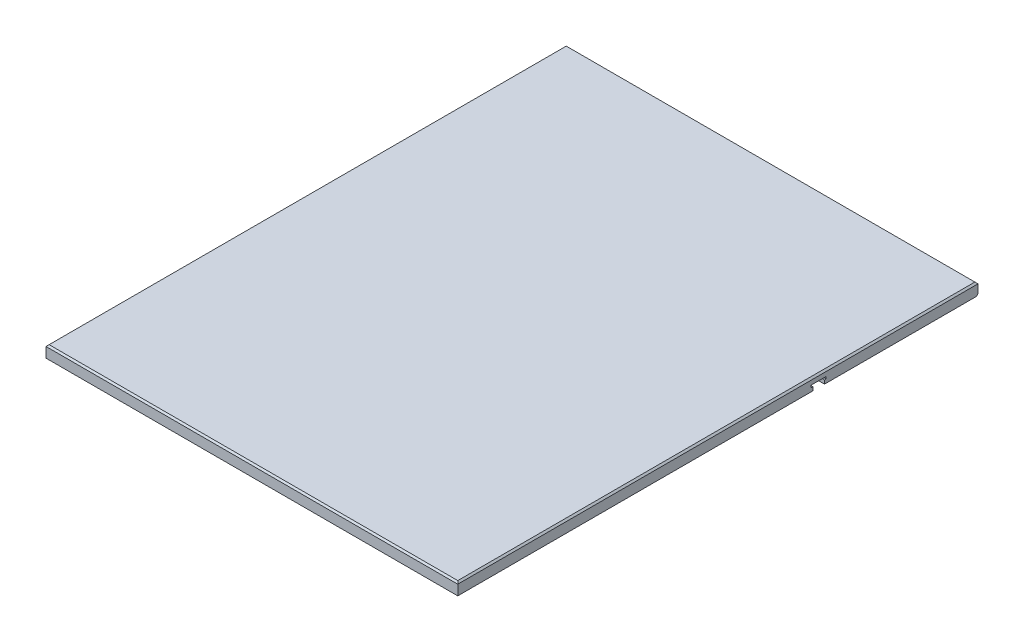
ISO-10303-21;
HEADER;
FILE_DESCRIPTION(('STEP AP214'),'2;1');
FILE_NAME('part.step','',(''),(''),'','','');
FILE_SCHEMA(('AUTOMOTIVE_DESIGN { 1 0 10303 214 1 1 1 1 }'));
ENDSEC;
DATA;
#1=APPLICATION_CONTEXT('core data for automotive mechanical design processes');
#2=APPLICATION_PROTOCOL_DEFINITION('international standard','automotive_design',2000,#1);
#3=PRODUCT_CONTEXT('',#1,'mechanical');
#4=PRODUCT('Part','Part','',(#3));
#5=PRODUCT_RELATED_PRODUCT_CATEGORY('part','',(#4));
#6=PRODUCT_DEFINITION_FORMATION('','',#4);
#7=PRODUCT_DEFINITION_CONTEXT('part definition',#1,'design');
#8=PRODUCT_DEFINITION('design','',#6,#7);
#9=PRODUCT_DEFINITION_SHAPE('','',#8);
#10=(LENGTH_UNIT() NAMED_UNIT(*) SI_UNIT(.MILLI.,.METRE.));
#11=(NAMED_UNIT(*) PLANE_ANGLE_UNIT() SI_UNIT($,.RADIAN.));
#12=(NAMED_UNIT(*) SI_UNIT($,.STERADIAN.) SOLID_ANGLE_UNIT());
#13=UNCERTAINTY_MEASURE_WITH_UNIT(LENGTH_MEASURE(1.E-05),#10,'distance_accuracy_value','');
#14=(GEOMETRIC_REPRESENTATION_CONTEXT(3) GLOBAL_UNCERTAINTY_ASSIGNED_CONTEXT((#13)) GLOBAL_UNIT_ASSIGNED_CONTEXT((#10,
#11,#12)) REPRESENTATION_CONTEXT('',''));
#15=CARTESIAN_POINT('',(0.,0.,0.));
#16=DIRECTION('',(0.,0.,1.));
#17=DIRECTION('',(1.,0.,0.));
#18=AXIS2_PLACEMENT_3D('',#15,#16,#17);
#19=CARTESIAN_POINT('',(0.,19.05,0.));
#20=DIRECTION('',(1.,0.,0.));
#21=DIRECTION('',(0.,0.,-1.));
#22=AXIS2_PLACEMENT_3D('',#19,#20,#21);
#23=PLANE('',#22);
#24=DIRECTION('',(0.,1.,0.));
#25=VECTOR('',#24,1.);
#26=CARTESIAN_POINT('',(0.,0.,-596.63076));
#27=LINE('',#26,#25);
#28=CARTESIAN_POINT('',(0.,0.,-596.63076));
#29=VERTEX_POINT('',#28);
#30=CARTESIAN_POINT('',(0.,5.97534999998061,-596.63076));
#31=VERTEX_POINT('',#30);
#32=EDGE_CURVE('E168',#29,#31,#27,.T.);
#33=ORIENTED_EDGE('',*,*,#32,.T.);
#34=DIRECTION('',(0.,0.,-1.));
#35=VECTOR('',#34,1.);
#36=CARTESIAN_POINT('',(0.,5.9753499999808,0.));
#37=LINE('',#36,#35);
#38=CARTESIAN_POINT('',(0.,5.97534999998061,-599.29776));
#39=VERTEX_POINT('',#38);
#40=EDGE_CURVE('E171',#31,#39,#37,.T.);
#41=ORIENTED_EDGE('',*,*,#40,.T.);
#42=DIRECTION('',(0.,1.,0.));
#43=VECTOR('',#42,1.);
#44=CARTESIAN_POINT('',(0.,0.,-599.29776));
#45=LINE('',#44,#43);
#46=CARTESIAN_POINT('',(0.,9.53134999998069,-599.29776));
#47=VERTEX_POINT('',#46);
#48=EDGE_CURVE('E192',#39,#47,#45,.T.);
#49=ORIENTED_EDGE('',*,*,#48,.T.);
#50=DIRECTION('',(0.,0.,1.));
#51=VECTOR('',#50,1.);
#52=CARTESIAN_POINT('',(0.,9.53134999998078,0.));
#53=LINE('',#52,#51);
#54=CARTESIAN_POINT('',(0.,9.5313499999807,-574.91376));
#55=VERTEX_POINT('',#54);
#56=EDGE_CURVE('E189',#47,#55,#53,.T.);
#57=ORIENTED_EDGE('',*,*,#56,.T.);
#58=DIRECTION('',(0.,-1.,0.));
#59=VECTOR('',#58,1.);
#60=CARTESIAN_POINT('',(0.,0.,-574.91376));
#61=LINE('',#60,#59);
#62=CARTESIAN_POINT('',(0.,5.97534999998061,-574.91376));
#63=VERTEX_POINT('',#62);
#64=EDGE_CURVE('E186',#55,#63,#61,.T.);
#65=ORIENTED_EDGE('',*,*,#64,.T.);
#66=DIRECTION('',(0.,0.,-1.));
#67=VECTOR('',#66,1.);
#68=CARTESIAN_POINT('',(0.,5.97534999998042,0.));
#69=LINE('',#68,#67);
#70=CARTESIAN_POINT('',(0.,5.97534999998061,-577.58076));
#71=VERTEX_POINT('',#70);
#72=EDGE_CURVE('E184',#63,#71,#69,.T.);
#73=ORIENTED_EDGE('',*,*,#72,.T.);
#74=DIRECTION('',(0.,-1.,0.));
#75=VECTOR('',#74,1.);
#76=CARTESIAN_POINT('',(0.,0.,-577.58076));
#77=LINE('',#76,#75);
#78=CARTESIAN_POINT('',(0.,0.,-577.58076));
#79=VERTEX_POINT('',#78);
#80=EDGE_CURVE('E160',#71,#79,#77,.T.);
#81=ORIENTED_EDGE('',*,*,#80,.T.);
#82=DIRECTION('',(0.,0.,1.));
#83=VECTOR('',#82,1.);
#84=CARTESIAN_POINT('',(0.,0.,0.));
#85=LINE('',#84,#83);
#86=CARTESIAN_POINT('',(0.,0.,0.));
#87=VERTEX_POINT('',#86);
#88=EDGE_CURVE('E215',#79,#87,#85,.T.);
#89=ORIENTED_EDGE('',*,*,#88,.T.);
#90=DIRECTION('',(0.,-1.,0.));
#91=VECTOR('',#90,1.);
#92=CARTESIAN_POINT('',(0.,19.05,0.));
#93=LINE('',#92,#91);
#94=CARTESIAN_POINT('',(0.,16.5100000000001,0.));
#95=VERTEX_POINT('',#94);
#96=EDGE_CURVE('E227',#95,#87,#93,.T.);
#97=ORIENTED_EDGE('',*,*,#96,.F.);
#98=DIRECTION('',(0.,0.,-1.));
#99=VECTOR('',#98,1.);
#100=CARTESIAN_POINT('',(0.,16.5100000000001,0.));
#101=LINE('',#100,#99);
#102=CARTESIAN_POINT('',(0.,16.5100000000001,-846.328));
#103=VERTEX_POINT('',#102);
#104=EDGE_CURVE('E246',#95,#103,#101,.T.);
#105=ORIENTED_EDGE('',*,*,#104,.T.);
#106=DIRECTION('',(0.,-1.,0.));
#107=VECTOR('',#106,1.);
#108=CARTESIAN_POINT('',(0.,19.05,-846.328));
#109=LINE('',#108,#107);
#110=CARTESIAN_POINT('',(0.,2.5400000000001,-846.328));
#111=VERTEX_POINT('',#110);
#112=EDGE_CURVE('E219',#103,#111,#109,.T.);
#113=ORIENTED_EDGE('',*,*,#112,.T.);
#114=DIRECTION('',(0.,-0.707106781186548,0.707106781186548));
#115=VECTOR('',#114,1.);
#116=CARTESIAN_POINT('',(0.,2.5400000000001,-846.328));
#117=LINE('',#116,#115);
#118=CARTESIAN_POINT('',(0.,0.,-843.788));
#119=VERTEX_POINT('',#118);
#120=EDGE_CURVE('E260',#111,#119,#117,.T.);
#121=ORIENTED_EDGE('',*,*,#120,.T.);
#122=EDGE_CURVE('E211',#119,#29,#85,.T.);
#123=ORIENTED_EDGE('',*,*,#122,.T.);
#124=EDGE_LOOP('',(#33,#41,#49,#57,#65,#73,#81,#89,#97,#105,#113,#121,#123));
#125=FACE_BOUND('',#124,.T.);
#126=ADVANCED_FACE('F40',(#125),#23,.F.);
#127=CARTESIAN_POINT('',(669.8488,19.05,0.));
#128=DIRECTION('',(-1.,0.,0.));
#129=DIRECTION('',(0.,0.,1.));
#130=AXIS2_PLACEMENT_3D('',#127,#128,#129);
#131=PLANE('',#130);
#132=DIRECTION('',(0.,1.,0.));
#133=VECTOR('',#132,1.);
#134=CARTESIAN_POINT('',(669.8488,0.,-596.63076));
#135=LINE('',#134,#133);
#136=CARTESIAN_POINT('',(669.8488,0.,-596.63076));
#137=VERTEX_POINT('',#136);
#138=CARTESIAN_POINT('',(669.8488,5.97534999998061,-596.63076));
#139=VERTEX_POINT('',#138);
#140=EDGE_CURVE('E181',#137,#139,#135,.T.);
#141=ORIENTED_EDGE('',*,*,#140,.F.);
#142=DIRECTION('',(0.,0.,-1.));
#143=VECTOR('',#142,1.);
#144=CARTESIAN_POINT('',(669.8488,0.,0.));
#145=LINE('',#144,#143);
#146=CARTESIAN_POINT('',(669.8488,0.,-843.788));
#147=VERTEX_POINT('',#146);
#148=EDGE_CURVE('E63',#137,#147,#145,.T.);
#149=ORIENTED_EDGE('',*,*,#148,.T.);
#150=DIRECTION('',(0.,0.707106781186548,-0.707106781186548));
#151=VECTOR('',#150,1.);
#152=CARTESIAN_POINT('',(669.8488,2.5400000000001,-846.328));
#153=LINE('',#152,#151);
#154=CARTESIAN_POINT('',(669.8488,2.5400000000001,-846.328));
#155=VERTEX_POINT('',#154);
#156=EDGE_CURVE('E11',#147,#155,#153,.T.);
#157=ORIENTED_EDGE('',*,*,#156,.T.);
#158=DIRECTION('',(0.,-1.,0.));
#159=VECTOR('',#158,1.);
#160=CARTESIAN_POINT('',(669.8488,19.05,-846.328));
#161=LINE('',#160,#159);
#162=CARTESIAN_POINT('',(669.8488,16.5100000000001,-846.328));
#163=VERTEX_POINT('',#162);
#164=EDGE_CURVE('E222',#163,#155,#161,.T.);
#165=ORIENTED_EDGE('',*,*,#164,.F.);
#166=DIRECTION('',(0.,0.,1.));
#167=VECTOR('',#166,1.);
#168=CARTESIAN_POINT('',(669.8488,16.5100000000001,0.));
#169=LINE('',#168,#167);
#170=CARTESIAN_POINT('',(669.8488,16.5100000000001,0.));
#171=VERTEX_POINT('',#170);
#172=EDGE_CURVE('E242',#163,#171,#169,.T.);
#173=ORIENTED_EDGE('',*,*,#172,.T.);
#174=DIRECTION('',(0.,-1.,0.));
#175=VECTOR('',#174,1.);
#176=CARTESIAN_POINT('',(669.8488,19.05,0.));
#177=LINE('',#176,#175);
#178=CARTESIAN_POINT('',(669.8488,0.,0.));
#179=VERTEX_POINT('',#178);
#180=EDGE_CURVE('E225',#171,#179,#177,.T.);
#181=ORIENTED_EDGE('',*,*,#180,.T.);
#182=CARTESIAN_POINT('',(669.8488,0.,-577.58076));
#183=VERTEX_POINT('',#182);
#184=EDGE_CURVE('E167',#179,#183,#145,.T.);
#185=ORIENTED_EDGE('',*,*,#184,.T.);
#186=DIRECTION('',(0.,-1.,0.));
#187=VECTOR('',#186,1.);
#188=CARTESIAN_POINT('',(669.8488,0.,-577.58076));
#189=LINE('',#188,#187);
#190=CARTESIAN_POINT('',(669.8488,5.97534999998061,-577.58076));
#191=VERTEX_POINT('',#190);
#192=EDGE_CURVE('E56',#191,#183,#189,.T.);
#193=ORIENTED_EDGE('',*,*,#192,.F.);
#194=DIRECTION('',(0.,0.,-1.));
#195=VECTOR('',#194,1.);
#196=CARTESIAN_POINT('',(669.8488,5.97534999998042,0.));
#197=LINE('',#196,#195);
#198=CARTESIAN_POINT('',(669.8488,5.97534999998061,-574.91376));
#199=VERTEX_POINT('',#198);
#200=EDGE_CURVE('E149',#199,#191,#197,.T.);
#201=ORIENTED_EDGE('',*,*,#200,.F.);
#202=DIRECTION('',(0.,-1.,0.));
#203=VECTOR('',#202,1.);
#204=CARTESIAN_POINT('',(669.8488,0.,-574.91376));
#205=LINE('',#204,#203);
#206=CARTESIAN_POINT('',(669.8488,9.5313499999807,-574.91376));
#207=VERTEX_POINT('',#206);
#208=EDGE_CURVE('E156',#207,#199,#205,.T.);
#209=ORIENTED_EDGE('',*,*,#208,.F.);
#210=DIRECTION('',(0.,0.,1.));
#211=VECTOR('',#210,1.);
#212=CARTESIAN_POINT('',(669.8488,9.53134999998078,0.));
#213=LINE('',#212,#211);
#214=CARTESIAN_POINT('',(669.8488,9.53134999998069,-599.29776));
#215=VERTEX_POINT('',#214);
#216=EDGE_CURVE('E175',#215,#207,#213,.T.);
#217=ORIENTED_EDGE('',*,*,#216,.F.);
#218=DIRECTION('',(0.,1.,0.));
#219=VECTOR('',#218,1.);
#220=CARTESIAN_POINT('',(669.8488,0.,-599.29776));
#221=LINE('',#220,#219);
#222=CARTESIAN_POINT('',(669.8488,5.97534999998061,-599.29776));
#223=VERTEX_POINT('',#222);
#224=EDGE_CURVE('E177',#223,#215,#221,.T.);
#225=ORIENTED_EDGE('',*,*,#224,.F.);
#226=DIRECTION('',(0.,0.,-1.));
#227=VECTOR('',#226,1.);
#228=CARTESIAN_POINT('',(669.8488,5.9753499999808,0.));
#229=LINE('',#228,#227);
#230=EDGE_CURVE('E179',#139,#223,#229,.T.);
#231=ORIENTED_EDGE('',*,*,#230,.F.);
#232=EDGE_LOOP('',(#141,#149,#157,#165,#173,#181,#185,#193,#201,#209,#217,#225,#231));
#233=FACE_BOUND('',#232,.T.);
#234=ADVANCED_FACE('F165',(#233),#131,.F.);
#235=CARTESIAN_POINT('',(0.,0.,0.));
#236=DIRECTION('',(0.,-1.,0.));
#237=DIRECTION('',(0.,0.,-1.));
#238=AXIS2_PLACEMENT_3D('',#235,#236,#237);
#239=PLANE('',#238);
#240=ORIENTED_EDGE('',*,*,#148,.F.);
#241=DIRECTION('',(-1.,0.,0.));
#242=VECTOR('',#241,1.);
#243=CARTESIAN_POINT('',(669.8488,0.,-596.63076));
#244=LINE('',#243,#242);
#245=EDGE_CURVE('E197',#137,#29,#244,.T.);
#246=ORIENTED_EDGE('',*,*,#245,.T.);
#247=ORIENTED_EDGE('',*,*,#122,.F.);
#248=DIRECTION('',(1.,0.,0.));
#249=VECTOR('',#248,1.);
#250=CARTESIAN_POINT('',(669.8488,0.,-843.788));
#251=LINE('',#250,#249);
#252=EDGE_CURVE('E49',#119,#147,#251,.T.);
#253=ORIENTED_EDGE('',*,*,#252,.T.);
#254=EDGE_LOOP('',(#240,#246,#247,#253));
#255=FACE_BOUND('',#254,.T.);
#256=ADVANCED_FACE('F265',(#255),#239,.T.);
#257=ORIENTED_EDGE('',*,*,#88,.F.);
#258=DIRECTION('',(-1.,0.,0.));
#259=VECTOR('',#258,1.);
#260=CARTESIAN_POINT('',(669.8488,0.,-577.58076));
#261=LINE('',#260,#259);
#262=EDGE_CURVE('E162',#183,#79,#261,.T.);
#263=ORIENTED_EDGE('',*,*,#262,.F.);
#264=ORIENTED_EDGE('',*,*,#184,.F.);
#265=DIRECTION('',(1.,0.,0.));
#266=VECTOR('',#265,1.);
#267=CARTESIAN_POINT('',(0.,0.,0.));
#268=LINE('',#267,#266);
#269=EDGE_CURVE('E214',#87,#179,#268,.T.);
#270=ORIENTED_EDGE('',*,*,#269,.F.);
#271=EDGE_LOOP('',(#257,#263,#264,#270));
#272=FACE_BOUND('',#271,.T.);
#273=ADVANCED_FACE('F361',(#272),#239,.T.);
#274=CARTESIAN_POINT('',(0.,19.05,0.));
#275=DIRECTION('',(0.,0.,-1.));
#276=DIRECTION('',(-1.,0.,0.));
#277=AXIS2_PLACEMENT_3D('',#274,#275,#276);
#278=PLANE('',#277);
#279=ORIENTED_EDGE('',*,*,#180,.F.);
#280=DIRECTION('',(-1.,0.,0.));
#281=VECTOR('',#280,1.);
#282=CARTESIAN_POINT('',(0.,16.5100000000001,0.));
#283=LINE('',#282,#281);
#284=EDGE_CURVE('E244',#171,#95,#283,.T.);
#285=ORIENTED_EDGE('',*,*,#284,.T.);
#286=ORIENTED_EDGE('',*,*,#96,.T.);
#287=ORIENTED_EDGE('',*,*,#269,.T.);
#288=EDGE_LOOP('',(#279,#285,#286,#287));
#289=FACE_BOUND('',#288,.T.);
#290=ADVANCED_FACE('F294',(#289),#278,.F.);
#291=CARTESIAN_POINT('',(0.,19.05,-846.328));
#292=DIRECTION('',(0.,0.,1.));
#293=DIRECTION('',(1.,0.,0.));
#294=AXIS2_PLACEMENT_3D('',#291,#292,#293);
#295=PLANE('',#294);
#296=ORIENTED_EDGE('',*,*,#164,.T.);
#297=DIRECTION('',(-1.,0.,0.));
#298=VECTOR('',#297,1.);
#299=CARTESIAN_POINT('',(0.,2.5400000000001,-846.328));
#300=LINE('',#299,#298);
#301=EDGE_CURVE('E248',#155,#111,#300,.T.);
#302=ORIENTED_EDGE('',*,*,#301,.T.);
#303=ORIENTED_EDGE('',*,*,#112,.F.);
#304=DIRECTION('',(1.,0.,0.));
#305=VECTOR('',#304,1.);
#306=CARTESIAN_POINT('',(0.,16.5100000000001,-846.328));
#307=LINE('',#306,#305);
#308=EDGE_CURVE('E239',#103,#163,#307,.T.);
#309=ORIENTED_EDGE('',*,*,#308,.T.);
#310=EDGE_LOOP('',(#296,#302,#303,#309));
#311=FACE_BOUND('',#310,.T.);
#312=ADVANCED_FACE('F270',(#311),#295,.F.);
#313=CARTESIAN_POINT('',(0.,19.05,0.));
#314=DIRECTION('',(0.,-1.,0.));
#315=DIRECTION('',(0.,0.,-1.));
#316=AXIS2_PLACEMENT_3D('',#313,#314,#315);
#317=PLANE('',#316);
#318=DIRECTION('',(0.,0.,-1.));
#319=VECTOR('',#318,1.);
#320=CARTESIAN_POINT('',(667.3088,19.05,0.));
#321=LINE('',#320,#319);
#322=CARTESIAN_POINT('',(667.3088,19.05,-2.53999999999999));
#323=VERTEX_POINT('',#322);
#324=CARTESIAN_POINT('',(667.3088,19.05,-843.788));
#325=VERTEX_POINT('',#324);
#326=EDGE_CURVE('E234',#323,#325,#321,.T.);
#327=ORIENTED_EDGE('',*,*,#326,.T.);
#328=DIRECTION('',(-1.,0.,0.));
#329=VECTOR('',#328,1.);
#330=CARTESIAN_POINT('',(0.,19.05,-843.788));
#331=LINE('',#330,#329);
#332=CARTESIAN_POINT('',(2.53999999999999,19.05,-843.788));
#333=VERTEX_POINT('',#332);
#334=EDGE_CURVE('E236',#325,#333,#331,.T.);
#335=ORIENTED_EDGE('',*,*,#334,.T.);
#336=DIRECTION('',(0.,0.,1.));
#337=VECTOR('',#336,1.);
#338=CARTESIAN_POINT('',(2.53999999999999,19.05,0.));
#339=LINE('',#338,#337);
#340=CARTESIAN_POINT('',(2.53999999999999,19.05,-2.53999999999999));
#341=VERTEX_POINT('',#340);
#342=EDGE_CURVE('E230',#333,#341,#339,.T.);
#343=ORIENTED_EDGE('',*,*,#342,.T.);
#344=DIRECTION('',(1.,0.,0.));
#345=VECTOR('',#344,1.);
#346=CARTESIAN_POINT('',(0.,19.05,-2.53999999999999));
#347=LINE('',#346,#345);
#348=EDGE_CURVE('E232',#341,#323,#347,.T.);
#349=ORIENTED_EDGE('',*,*,#348,.T.);
#350=EDGE_LOOP('',(#327,#335,#343,#349));
#351=FACE_BOUND('',#350,.T.);
#352=ADVANCED_FACE('F286',(#351),#317,.F.);
#353=CARTESIAN_POINT('',(0.,19.05,-2.53999999999999));
#354=DIRECTION('',(0.,-0.707106781186563,-0.707106781186532));
#355=DIRECTION('',(1.,0.,0.));
#356=AXIS2_PLACEMENT_3D('',#353,#354,#355);
#357=PLANE('',#356);
#358=DIRECTION('',(0.577350269189634,0.577350269189609,-0.577350269189634));
#359=VECTOR('',#358,1.);
#360=CARTESIAN_POINT('',(1.6933333333333,18.2033333333334,-1.6933333333333));
#361=LINE('',#360,#359);
#362=EDGE_CURVE('E252',#95,#341,#361,.T.);
#363=ORIENTED_EDGE('',*,*,#362,.F.);
#364=ORIENTED_EDGE('',*,*,#284,.F.);
#365=DIRECTION('',(-0.577350269189634,0.577350269189609,-0.577350269189634));
#366=VECTOR('',#365,1.);
#367=CARTESIAN_POINT('',(444.872533333327,241.486266666664,-224.976266666673));
#368=LINE('',#367,#366);
#369=EDGE_CURVE('E255',#323,#171,#368,.F.);
#370=ORIENTED_EDGE('',*,*,#369,.F.);
#371=ORIENTED_EDGE('',*,*,#348,.F.);
#372=EDGE_LOOP('',(#363,#364,#370,#371));
#373=FACE_BOUND('',#372,.T.);
#374=ADVANCED_FACE('F298',(#373),#357,.F.);
#375=CARTESIAN_POINT('',(667.3088,19.05,0.));
#376=DIRECTION('',(-0.707106781186532,-0.707106781186563,0.));
#377=DIRECTION('',(0.,0.,-1.));
#378=AXIS2_PLACEMENT_3D('',#375,#376,#377);
#379=PLANE('',#378);
#380=ORIENTED_EDGE('',*,*,#369,.T.);
#381=ORIENTED_EDGE('',*,*,#172,.F.);
#382=DIRECTION('',(-0.577350269189634,0.577350269189609,0.577350269189634));
#383=VECTOR('',#382,1.);
#384=CARTESIAN_POINT('',(386.046133333325,300.312666666663,-562.525333333325));
#385=LINE('',#384,#383);
#386=EDGE_CURVE('E250',#325,#163,#385,.F.);
#387=ORIENTED_EDGE('',*,*,#386,.F.);
#388=ORIENTED_EDGE('',*,*,#326,.F.);
#389=EDGE_LOOP('',(#380,#381,#387,#388));
#390=FACE_BOUND('',#389,.T.);
#391=ADVANCED_FACE('F290',(#390),#379,.F.);
#392=CARTESIAN_POINT('',(2.53999999999999,19.05,0.));
#393=DIRECTION('',(0.707106781186532,-0.707106781186563,0.));
#394=DIRECTION('',(0.,0.,1.));
#395=AXIS2_PLACEMENT_3D('',#392,#393,#394);
#396=PLANE('',#395);
#397=ORIENTED_EDGE('',*,*,#362,.T.);
#398=ORIENTED_EDGE('',*,*,#342,.F.);
#399=DIRECTION('',(-0.577350269189634,-0.577350269189609,-0.577350269189634));
#400=VECTOR('',#399,1.);
#401=CARTESIAN_POINT('',(283.802666666675,300.312666666663,-562.525333333325));
#402=LINE('',#401,#400);
#403=EDGE_CURVE('E200',#103,#333,#402,.F.);
#404=ORIENTED_EDGE('',*,*,#403,.F.);
#405=ORIENTED_EDGE('',*,*,#104,.F.);
#406=EDGE_LOOP('',(#397,#398,#404,#405));
#407=FACE_BOUND('',#406,.T.);
#408=ADVANCED_FACE('F282',(#407),#396,.F.);
#409=CARTESIAN_POINT('',(0.,19.05,-843.788));
#410=DIRECTION('',(0.,-0.707106781186563,0.707106781186532));
#411=DIRECTION('',(-1.,0.,0.));
#412=AXIS2_PLACEMENT_3D('',#409,#410,#411);
#413=PLANE('',#412);
#414=ORIENTED_EDGE('',*,*,#386,.T.);
#415=ORIENTED_EDGE('',*,*,#308,.F.);
#416=ORIENTED_EDGE('',*,*,#403,.T.);
#417=ORIENTED_EDGE('',*,*,#334,.F.);
#418=EDGE_LOOP('',(#414,#415,#416,#417));
#419=FACE_BOUND('',#418,.T.);
#420=ADVANCED_FACE('F275',(#419),#413,.F.);
#421=CARTESIAN_POINT('',(0.,2.5400000000001,-846.328));
#422=DIRECTION('',(0.,-0.707106781186548,-0.707106781186548));
#423=DIRECTION('',(1.,0.,0.));
#424=AXIS2_PLACEMENT_3D('',#421,#422,#423);
#425=PLANE('',#424);
#426=ORIENTED_EDGE('',*,*,#156,.F.);
#427=ORIENTED_EDGE('',*,*,#252,.F.);
#428=ORIENTED_EDGE('',*,*,#120,.F.);
#429=ORIENTED_EDGE('',*,*,#301,.F.);
#430=EDGE_LOOP('',(#426,#427,#428,#429));
#431=FACE_BOUND('',#430,.T.);
#432=ADVANCED_FACE('F43',(#431),#425,.T.);
#433=CARTESIAN_POINT('',(669.8488,0.,-596.63076));
#434=DIRECTION('',(0.,0.,1.));
#435=DIRECTION('',(1.,0.,0.));
#436=AXIS2_PLACEMENT_3D('',#433,#434,#435);
#437=PLANE('',#436);
#438=ORIENTED_EDGE('',*,*,#32,.F.);
#439=ORIENTED_EDGE('',*,*,#245,.F.);
#440=ORIENTED_EDGE('',*,*,#140,.T.);
#441=DIRECTION('',(-1.,0.,0.));
#442=VECTOR('',#441,1.);
#443=CARTESIAN_POINT('',(669.8488,5.97534999998061,-596.63076));
#444=LINE('',#443,#442);
#445=EDGE_CURVE('E201',#139,#31,#444,.T.);
#446=ORIENTED_EDGE('',*,*,#445,.T.);
#447=EDGE_LOOP('',(#438,#439,#440,#446));
#448=FACE_BOUND('',#447,.T.);
#449=ADVANCED_FACE('F354',(#448),#437,.T.);
#450=CARTESIAN_POINT('',(669.8488,5.9753499999808,0.));
#451=DIRECTION('',(0.,1.,0.));
#452=DIRECTION('',(0.,0.,1.));
#453=AXIS2_PLACEMENT_3D('',#450,#451,#452);
#454=PLANE('',#453);
#455=ORIENTED_EDGE('',*,*,#40,.F.);
#456=ORIENTED_EDGE('',*,*,#445,.F.);
#457=ORIENTED_EDGE('',*,*,#230,.T.);
#458=DIRECTION('',(-1.,0.,0.));
#459=VECTOR('',#458,1.);
#460=CARTESIAN_POINT('',(669.8488,5.97534999998061,-599.29776));
#461=LINE('',#460,#459);
#462=EDGE_CURVE('E203',#223,#39,#461,.T.);
#463=ORIENTED_EDGE('',*,*,#462,.T.);
#464=EDGE_LOOP('',(#455,#456,#457,#463));
#465=FACE_BOUND('',#464,.T.);
#466=ADVANCED_FACE('F389',(#465),#454,.T.);
#467=CARTESIAN_POINT('',(669.8488,0.,-599.29776));
#468=DIRECTION('',(0.,0.,1.));
#469=DIRECTION('',(1.,0.,0.));
#470=AXIS2_PLACEMENT_3D('',#467,#468,#469);
#471=PLANE('',#470);
#472=ORIENTED_EDGE('',*,*,#48,.F.);
#473=ORIENTED_EDGE('',*,*,#462,.F.);
#474=ORIENTED_EDGE('',*,*,#224,.T.);
#475=DIRECTION('',(-1.,0.,0.));
#476=VECTOR('',#475,1.);
#477=CARTESIAN_POINT('',(669.8488,9.53134999998069,-599.29776));
#478=LINE('',#477,#476);
#479=EDGE_CURVE('E205',#215,#47,#478,.T.);
#480=ORIENTED_EDGE('',*,*,#479,.T.);
#481=EDGE_LOOP('',(#472,#473,#474,#480));
#482=FACE_BOUND('',#481,.T.);
#483=ADVANCED_FACE('F399',(#482),#471,.T.);
#484=CARTESIAN_POINT('',(669.8488,9.53134999998078,0.));
#485=DIRECTION('',(0.,-1.,0.));
#486=DIRECTION('',(0.,0.,-1.));
#487=AXIS2_PLACEMENT_3D('',#484,#485,#486);
#488=PLANE('',#487);
#489=ORIENTED_EDGE('',*,*,#56,.F.);
#490=ORIENTED_EDGE('',*,*,#479,.F.);
#491=ORIENTED_EDGE('',*,*,#216,.T.);
#492=DIRECTION('',(-1.,0.,0.));
#493=VECTOR('',#492,1.);
#494=CARTESIAN_POINT('',(669.8488,9.5313499999807,-574.91376));
#495=LINE('',#494,#493);
#496=EDGE_CURVE('E207',#207,#55,#495,.T.);
#497=ORIENTED_EDGE('',*,*,#496,.T.);
#498=EDGE_LOOP('',(#489,#490,#491,#497));
#499=FACE_BOUND('',#498,.T.);
#500=ADVANCED_FACE('F409',(#499),#488,.T.);
#501=CARTESIAN_POINT('',(669.8488,0.,-574.91376));
#502=DIRECTION('',(0.,0.,-1.));
#503=DIRECTION('',(-1.,0.,0.));
#504=AXIS2_PLACEMENT_3D('',#501,#502,#503);
#505=PLANE('',#504);
#506=ORIENTED_EDGE('',*,*,#64,.F.);
#507=ORIENTED_EDGE('',*,*,#496,.F.);
#508=ORIENTED_EDGE('',*,*,#208,.T.);
#509=DIRECTION('',(-1.,0.,0.));
#510=VECTOR('',#509,1.);
#511=CARTESIAN_POINT('',(669.8488,5.97534999998061,-574.91376));
#512=LINE('',#511,#510);
#513=EDGE_CURVE('E154',#199,#63,#512,.T.);
#514=ORIENTED_EDGE('',*,*,#513,.T.);
#515=EDGE_LOOP('',(#506,#507,#508,#514));
#516=FACE_BOUND('',#515,.T.);
#517=ADVANCED_FACE('F419',(#516),#505,.T.);
#518=CARTESIAN_POINT('',(669.8488,5.97534999998042,0.));
#519=DIRECTION('',(0.,1.,0.));
#520=DIRECTION('',(0.,0.,1.));
#521=AXIS2_PLACEMENT_3D('',#518,#519,#520);
#522=PLANE('',#521);
#523=ORIENTED_EDGE('',*,*,#72,.F.);
#524=ORIENTED_EDGE('',*,*,#513,.F.);
#525=ORIENTED_EDGE('',*,*,#200,.T.);
#526=DIRECTION('',(-1.,0.,0.));
#527=VECTOR('',#526,1.);
#528=CARTESIAN_POINT('',(669.8488,5.97534999998061,-577.58076));
#529=LINE('',#528,#527);
#530=EDGE_CURVE('E152',#191,#71,#529,.T.);
#531=ORIENTED_EDGE('',*,*,#530,.T.);
#532=EDGE_LOOP('',(#523,#524,#525,#531));
#533=FACE_BOUND('',#532,.T.);
#534=ADVANCED_FACE('F151',(#533),#522,.T.);
#535=CARTESIAN_POINT('',(669.8488,0.,-577.58076));
#536=DIRECTION('',(0.,0.,-1.));
#537=DIRECTION('',(-1.,0.,0.));
#538=AXIS2_PLACEMENT_3D('',#535,#536,#537);
#539=PLANE('',#538);
#540=ORIENTED_EDGE('',*,*,#80,.F.);
#541=ORIENTED_EDGE('',*,*,#530,.F.);
#542=ORIENTED_EDGE('',*,*,#192,.T.);
#543=ORIENTED_EDGE('',*,*,#262,.T.);
#544=EDGE_LOOP('',(#540,#541,#542,#543));
#545=FACE_BOUND('',#544,.T.);
#546=ADVANCED_FACE('F158',(#545),#539,.T.);
#547=CLOSED_SHELL('',(#126,#234,#256,#273,#290,#312,#352,#374,#391,#408,#420,#432,#449,#466,
#483,#500,#517,#534,#546));
#548=MANIFOLD_SOLID_BREP('B2',#547);
#549=ADVANCED_BREP_SHAPE_REPRESENTATION('',(#18,#548),#14);
#550=SHAPE_DEFINITION_REPRESENTATION(#9,#549);
ENDSEC;
END-ISO-10303-21;
